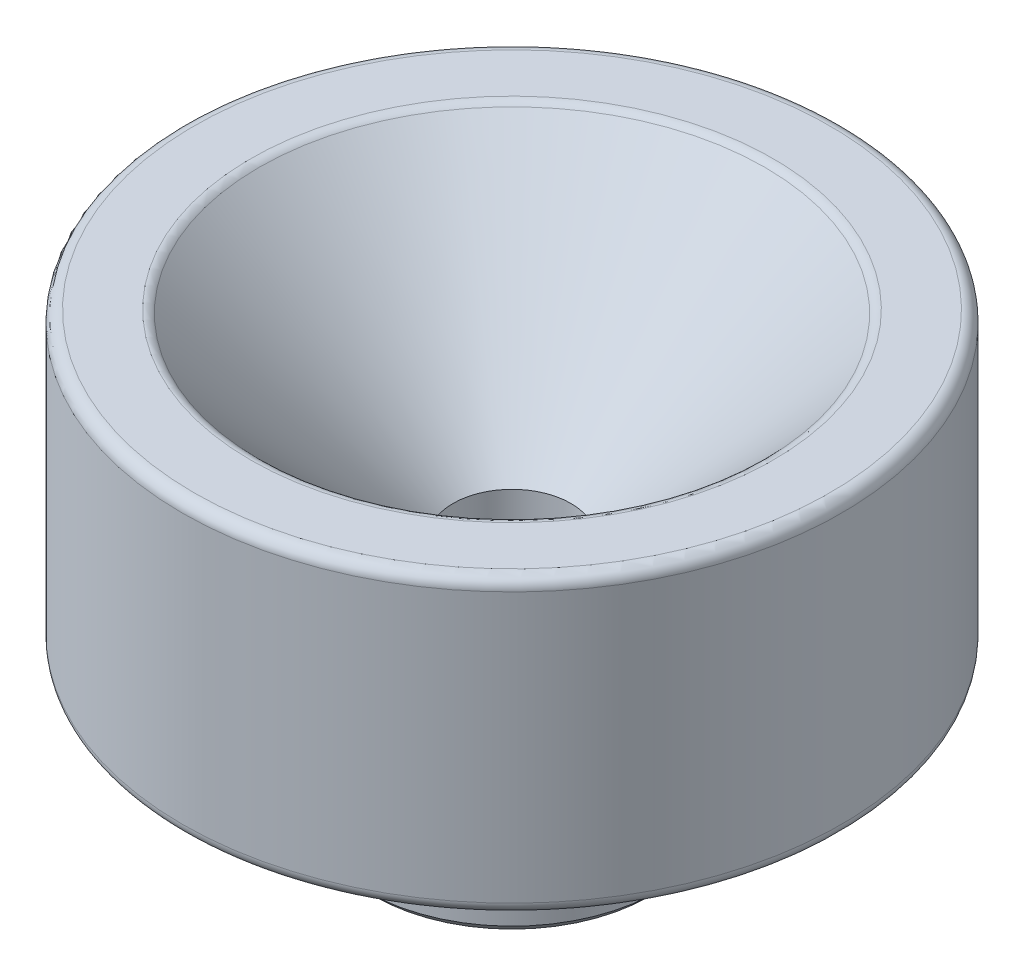
ISO-10303-21;
HEADER;
FILE_DESCRIPTION(('STEP AP214'),'2;1');
FILE_NAME('part.step','',(''),(''),'','','');
FILE_SCHEMA(('AUTOMOTIVE_DESIGN { 1 0 10303 214 1 1 1 1 }'));
ENDSEC;
DATA;
#1=APPLICATION_CONTEXT('core data for automotive mechanical design processes');
#2=APPLICATION_PROTOCOL_DEFINITION('international standard','automotive_design',2000,#1);
#3=PRODUCT_CONTEXT('',#1,'mechanical');
#4=PRODUCT('Part','Part','',(#3));
#5=PRODUCT_RELATED_PRODUCT_CATEGORY('part','',(#4));
#6=PRODUCT_DEFINITION_FORMATION('','',#4);
#7=PRODUCT_DEFINITION_CONTEXT('part definition',#1,'design');
#8=PRODUCT_DEFINITION('design','',#6,#7);
#9=PRODUCT_DEFINITION_SHAPE('','',#8);
#10=(LENGTH_UNIT() NAMED_UNIT(*) SI_UNIT(.MILLI.,.METRE.));
#11=(NAMED_UNIT(*) PLANE_ANGLE_UNIT() SI_UNIT($,.RADIAN.));
#12=(NAMED_UNIT(*) SI_UNIT($,.STERADIAN.) SOLID_ANGLE_UNIT());
#13=UNCERTAINTY_MEASURE_WITH_UNIT(LENGTH_MEASURE(1.E-05),#10,'distance_accuracy_value','');
#14=(GEOMETRIC_REPRESENTATION_CONTEXT(3) GLOBAL_UNCERTAINTY_ASSIGNED_CONTEXT((#13)) GLOBAL_UNIT_ASSIGNED_CONTEXT((#10,
#11,#12)) REPRESENTATION_CONTEXT('',''));
#15=CARTESIAN_POINT('',(0.,0.,0.));
#16=DIRECTION('',(0.,0.,1.));
#17=DIRECTION('',(1.,0.,0.));
#18=AXIS2_PLACEMENT_3D('',#15,#16,#17);
#19=CARTESIAN_POINT('',(6.35,0.,0.));
#20=DIRECTION('',(0.,-1.,0.));
#21=DIRECTION('',(0.,0.,-1.));
#22=AXIS2_PLACEMENT_3D('',#19,#20,#21);
#23=PLANE('',#22);
#24=CARTESIAN_POINT('',(0.,0.,0.));
#25=DIRECTION('',(0.,-1.,0.));
#26=DIRECTION('',(0.,0.,-1.));
#27=AXIS2_PLACEMENT_3D('',#24,#25,#26);
#28=CIRCLE('',#27,13.7795);
#29=CARTESIAN_POINT('',(0.,0.,-13.7795));
#30=VERTEX_POINT('',#29);
#31=EDGE_CURVE('E70',#30,#30,#28,.T.);
#32=ORIENTED_EDGE('',*,*,#31,.T.);
#33=EDGE_LOOP('',(#32));
#34=FACE_BOUND('',#33,.T.);
#35=CARTESIAN_POINT('',(0.,0.,0.));
#36=DIRECTION('',(0.,-1.,0.));
#37=DIRECTION('',(0.,0.,-1.));
#38=AXIS2_PLACEMENT_3D('',#35,#36,#37);
#39=CIRCLE('',#38,7.42596126628495);
#40=CARTESIAN_POINT('',(0.,0.,-7.42596126628495));
#41=VERTEX_POINT('',#40);
#42=EDGE_CURVE('E74',#41,#41,#39,.F.);
#43=ORIENTED_EDGE('',*,*,#42,.T.);
#44=EDGE_LOOP('',(#43));
#45=FACE_BOUND('',#44,.T.);
#46=ADVANCED_FACE('F35',(#34,#45),#23,.T.);
#47=CARTESIAN_POINT('',(0.,12.7,0.));
#48=DIRECTION('',(0.,1.,0.));
#49=DIRECTION('',(0.,0.,1.));
#50=AXIS2_PLACEMENT_3D('',#47,#48,#49);
#51=CONICAL_SURFACE('',#50,11.1125,0.785398163397443);
#52=CARTESIAN_POINT('',(0.,4.14019999999989,0.));
#53=DIRECTION('',(0.,1.,0.));
#54=DIRECTION('',(0.,0.,1.));
#55=AXIS2_PLACEMENT_3D('',#52,#53,#54);
#56=CIRCLE('',#55,2.55269999999999);
#57=CARTESIAN_POINT('',(0.,4.14019999999989,2.55269999999998));
#58=VERTEX_POINT('',#57);
#59=EDGE_CURVE('E77',#58,#58,#56,.T.);
#60=CARTESIAN_POINT('',(0.,12.5512102448428,0.));
#61=DIRECTION('',(0.,-1.,0.));
#62=DIRECTION('',(0.,0.,-1.));
#63=AXIS2_PLACEMENT_3D('',#60,#61,#62);
#64=CIRCLE('',#63,10.9637102448428);
#65=CARTESIAN_POINT('',(0.,12.5512102448428,10.9637102448428));
#66=VERTEX_POINT('',#65);
#67=EDGE_CURVE('E55',#66,#66,#64,.F.);
#68=CARTESIAN_POINT('',(0.,4.14019999999989,2.55269999999998));
#69=CARTESIAN_POINT('',(0.,4.22781469005034,2.64031469005043));
#70=CARTESIAN_POINT('',(0.,4.31542938010078,2.72792938010087));
#71=CARTESIAN_POINT('',(0.,4.49065876020168,2.90315876020177));
#72=CARTESIAN_POINT('',(0.,4.57827345025212,2.99077345025221));
#73=CARTESIAN_POINT('',(0.,4.75350283035302,3.1660028303531));
#74=CARTESIAN_POINT('',(0.,4.84111752040346,3.25361752040355));
#75=CARTESIAN_POINT('',(0.,5.01634690050436,3.42884690050444));
#76=CARTESIAN_POINT('',(0.,5.1039615905548,3.51646159055489));
#77=CARTESIAN_POINT('',(0.,5.2791909706557,3.69169097065578));
#78=CARTESIAN_POINT('',(0.,5.36680566070614,3.77930566070622));
#79=CARTESIAN_POINT('',(0.,5.54203504080704,3.95453504080711));
#80=CARTESIAN_POINT('',(0.,5.62964973085748,4.04214973085756));
#81=CARTESIAN_POINT('',(0.,5.80487911095838,4.21737911095845));
#82=CARTESIAN_POINT('',(0.,5.89249380100882,4.3049938010089));
#83=CARTESIAN_POINT('',(0.,6.06772318110972,4.48022318110979));
#84=CARTESIAN_POINT('',(0.,6.15533787116016,4.56783787116023));
#85=CARTESIAN_POINT('',(0.,6.33056725126106,4.74306725126112));
#86=CARTESIAN_POINT('',(0.,6.4181819413115,4.83068194131157));
#87=CARTESIAN_POINT('',(0.,6.5934113214124,5.00591132141246));
#88=CARTESIAN_POINT('',(0.,6.68102601146284,5.09352601146291));
#89=CARTESIAN_POINT('',(0.,6.85625539156374,5.2687553915638));
#90=CARTESIAN_POINT('',(0.,6.94387008161418,5.35637008161425));
#91=CARTESIAN_POINT('',(0.,7.11909946171508,5.53159946171514));
#92=CARTESIAN_POINT('',(0.,7.20671415176552,5.61921415176558));
#93=CARTESIAN_POINT('',(0.,7.38194353186642,5.79444353186647));
#94=CARTESIAN_POINT('',(0.,7.46955822191686,5.88205822191692));
#95=CARTESIAN_POINT('',(0.,7.64478760201776,6.05728760201781));
#96=CARTESIAN_POINT('',(0.,7.7324022920682,6.14490229206826));
#97=CARTESIAN_POINT('',(0.,7.9076316721691,6.32013167216915));
#98=CARTESIAN_POINT('',(0.,7.99524636221954,6.40774636221959));
#99=CARTESIAN_POINT('',(0.,8.17047574232044,6.58297574232048));
#100=CARTESIAN_POINT('',(0.,8.25809043237088,6.67059043237093));
#101=CARTESIAN_POINT('',(0.,8.43331981247178,6.84581981247182));
#102=CARTESIAN_POINT('',(0.,8.52093450252222,6.93343450252227));
#103=CARTESIAN_POINT('',(0.,8.69616388262311,7.10866388262316));
#104=CARTESIAN_POINT('',(0.,8.78377857267356,7.1962785726736));
#105=CARTESIAN_POINT('',(0.,8.95900795277445,7.37150795277449));
#106=CARTESIAN_POINT('',(0.,9.0466226428249,7.45912264282494));
#107=CARTESIAN_POINT('',(0.,9.2218520229258,7.63435202292583));
#108=CARTESIAN_POINT('',(0.,9.30946671297624,7.72196671297628));
#109=CARTESIAN_POINT('',(0.,9.48469609307713,7.89719609307717));
#110=CARTESIAN_POINT('',(0.,9.57231078312758,7.98481078312761));
#111=CARTESIAN_POINT('',(0.,9.74754016322848,8.1600401632285));
#112=CARTESIAN_POINT('',(0.,9.83515485327892,8.24765485327895));
#113=CARTESIAN_POINT('',(0.,10.0103842333798,8.42288423337984));
#114=CARTESIAN_POINT('',(0.,10.0979989234303,8.51049892343029));
#115=CARTESIAN_POINT('',(0.,10.2732283035312,8.68572830353118));
#116=CARTESIAN_POINT('',(0.,10.3608429935816,8.77334299358163));
#117=CARTESIAN_POINT('',(0.,10.5360723736825,8.94857237368252));
#118=CARTESIAN_POINT('',(0.,10.6236870637329,9.03618706373296));
#119=CARTESIAN_POINT('',(0.,10.7989164438338,9.21141644383385));
#120=CARTESIAN_POINT('',(0.,10.8865311338843,9.2990311338843));
#121=CARTESIAN_POINT('',(0.,11.0617605139852,9.47426051398519));
#122=CARTESIAN_POINT('',(0.,11.1493752040356,9.56187520403564));
#123=CARTESIAN_POINT('',(0.,11.3246045841365,9.73710458413653));
#124=CARTESIAN_POINT('',(0.,11.412219274187,9.82471927418697));
#125=CARTESIAN_POINT('',(0.,11.5874486542879,9.99994865428786));
#126=CARTESIAN_POINT('',(0.,11.6750633443383,10.0875633443383));
#127=CARTESIAN_POINT('',(0.,11.8502927244392,10.2627927244392));
#128=CARTESIAN_POINT('',(0.,11.9379074144896,10.3504074144896));
#129=CARTESIAN_POINT('',(0.,12.1131367945905,10.5256367945905));
#130=CARTESIAN_POINT('',(0.,12.200751484641,10.613251484641));
#131=CARTESIAN_POINT('',(0.,12.3759808647419,10.7884808647419));
#132=CARTESIAN_POINT('',(0.,12.4635955547923,10.8760955547923));
#133=CARTESIAN_POINT('',(0.,12.5512102448428,10.9637102448428));
#134=B_SPLINE_CURVE_WITH_KNOTS('',3,(#68,#69,#70,#71,#72,#73,#74,#75,#76,#77,#78,#79,#80,#81,
#82,#83,#84,#85,#86,#87,#88,#89,#90,#91,#92,#93,#94,#95,#96,#97,#98,#99,#100,#101,#102,#103,
#104,#105,#106,#107,#108,#109,#110,#111,#112,#113,#114,#115,#116,#117,#118,#119,#120,#121,#122,
#123,#124,#125,#126,#127,#128,#129,#130,#131,#132,#133),.UNSPECIFIED.,.F.,.F.,(4,2,2,2,2,2,2,2,
2,2,2,2,2,2,2,2,2,2,2,2,2,2,2,2,2,2,2,2,2,2,2,2,4),(0.,0.371717648797367,0.743435297594734,
1.1151529463921,1.48687059518947,1.85858824398684,2.23030589278421,2.60202354158158,
2.97374119037894,3.34545883917631,3.71717648797368,4.08889413677105,4.46061178556841,
4.83232943436578,5.20404708316315,5.57576473196052,5.94748238075789,6.31920002955525,
6.69091767835262,7.06263532714999,7.43435297594736,7.80607062474473,8.17778827354209,
8.54950592233946,8.92122357113683,9.29294121993419,9.66465886873156,10.0363765175289,
10.4080941663263,10.7798118151237,11.151529463921,11.5232471127184,11.8949647615158),.UNSPECIFIED.);
#135=EDGE_CURVE('BSEAM85',#58,#66,#134,.T.);
#136=ORIENTED_EDGE('',*,*,#59,.F.);
#137=ORIENTED_EDGE('',*,*,#67,.T.);
#138=ORIENTED_EDGE('',*,*,#135,.T.);
#139=ORIENTED_EDGE('',*,*,#135,.F.);
#140=EDGE_LOOP('',(#136,#138,#137,#139));
#141=FACE_BOUND('',#140,.T.);
#142=ADVANCED_FACE('F85',(#141),#51,.F.);
#143=CARTESIAN_POINT('',(14.2875,12.7,0.));
#144=DIRECTION('',(0.,1.,0.));
#145=DIRECTION('',(0.,0.,1.));
#146=AXIS2_PLACEMENT_3D('',#143,#144,#145);
#147=PLANE('',#146);
#148=CARTESIAN_POINT('',(0.,12.7,0.));
#149=DIRECTION('',(0.,1.,0.));
#150=DIRECTION('',(0.,0.,1.));
#151=AXIS2_PLACEMENT_3D('',#148,#149,#150);
#152=CIRCLE('',#151,13.7795);
#153=CARTESIAN_POINT('',(0.,12.7,13.7795));
#154=VERTEX_POINT('',#153);
#155=EDGE_CURVE('E58',#154,#154,#152,.T.);
#156=ORIENTED_EDGE('',*,*,#155,.T.);
#157=EDGE_LOOP('',(#156));
#158=FACE_BOUND('',#157,.T.);
#159=CARTESIAN_POINT('',(0.,12.7,0.));
#160=DIRECTION('',(0.,1.,0.));
#161=DIRECTION('',(0.,0.,1.));
#162=AXIS2_PLACEMENT_3D('',#159,#160,#161);
#163=CIRCLE('',#162,11.3229204896855);
#164=CARTESIAN_POINT('',(0.,12.7,11.3229204896855));
#165=VERTEX_POINT('',#164);
#166=EDGE_CURVE('E61',#165,#165,#163,.F.);
#167=ORIENTED_EDGE('',*,*,#166,.T.);
#168=EDGE_LOOP('',(#167));
#169=FACE_BOUND('',#168,.T.);
#170=ADVANCED_FACE('F88',(#158,#169),#147,.T.);
#171=CARTESIAN_POINT('',(0.,0.,0.));
#172=DIRECTION('',(0.,-1.,0.));
#173=DIRECTION('',(0.,0.,-1.));
#174=AXIS2_PLACEMENT_3D('',#171,#172,#173);
#175=CYLINDRICAL_SURFACE('',#174,14.2875);
#176=CARTESIAN_POINT('',(0.,0.508,0.));
#177=DIRECTION('',(0.,-1.,0.));
#178=DIRECTION('',(0.,0.,-1.));
#179=AXIS2_PLACEMENT_3D('',#176,#177,#178);
#180=CIRCLE('',#179,14.2875);
#181=CARTESIAN_POINT('',(0.,0.508,-14.2875));
#182=VERTEX_POINT('',#181);
#183=EDGE_CURVE('E64',#182,#182,#180,.F.);
#184=ORIENTED_EDGE('',*,*,#183,.T.);
#185=EDGE_LOOP('',(#184));
#186=FACE_BOUND('',#185,.T.);
#187=CARTESIAN_POINT('',(0.,12.192,0.));
#188=DIRECTION('',(0.,1.,0.));
#189=DIRECTION('',(0.,0.,1.));
#190=AXIS2_PLACEMENT_3D('',#187,#188,#189);
#191=CIRCLE('',#190,14.2875);
#192=CARTESIAN_POINT('',(0.,12.192,14.2875));
#193=VERTEX_POINT('',#192);
#194=EDGE_CURVE('E67',#193,#193,#191,.F.);
#195=ORIENTED_EDGE('',*,*,#194,.T.);
#196=EDGE_LOOP('',(#195));
#197=FACE_BOUND('',#196,.T.);
#198=ADVANCED_FACE('F101',(#186,#197),#175,.T.);
#199=CARTESIAN_POINT('',(0.,-0.508,0.));
#200=DIRECTION('',(0.,1.,0.));
#201=DIRECTION('',(0.,0.,1.));
#202=AXIS2_PLACEMENT_3D('',#199,#200,#201);
#203=TOROIDAL_SURFACE('',#202,6.858,0.762000000000001);
#204=CARTESIAN_POINT('',(0.,-1.07596126628495,0.));
#205=DIRECTION('',(0.,1.,0.));
#206=DIRECTION('',(0.,0.,1.));
#207=AXIS2_PLACEMENT_3D('',#204,#205,#206);
#208=CIRCLE('',#207,6.35);
#209=CARTESIAN_POINT('',(0.,-1.07596126628495,6.35));
#210=VERTEX_POINT('',#209);
#211=EDGE_CURVE('E73',#210,#210,#208,.F.);
#212=ORIENTED_EDGE('',*,*,#211,.F.);
#213=EDGE_LOOP('',(#212));
#214=FACE_BOUND('',#213,.T.);
#215=ORIENTED_EDGE('',*,*,#42,.F.);
#216=EDGE_LOOP('',(#215));
#217=FACE_BOUND('',#216,.T.);
#218=ADVANCED_FACE('F107',(#214,#217),#203,.F.);
#219=CARTESIAN_POINT('',(0.,-6.35,0.));
#220=DIRECTION('',(0.,-1.,0.));
#221=DIRECTION('',(0.,0.,-1.));
#222=AXIS2_PLACEMENT_3D('',#219,#220,#221);
#223=PLANE('',#222);
#224=CARTESIAN_POINT('',(0.,-6.35,0.));
#225=DIRECTION('',(0.,-1.,0.));
#226=DIRECTION('',(0.,0.,-1.));
#227=AXIS2_PLACEMENT_3D('',#224,#225,#226);
#228=CIRCLE('',#227,2.9337);
#229=CARTESIAN_POINT('',(0.,-6.35,-2.9337));
#230=VERTEX_POINT('',#229);
#231=EDGE_CURVE('E10',#230,#230,#228,.F.);
#232=ORIENTED_EDGE('',*,*,#231,.T.);
#233=EDGE_LOOP('',(#232));
#234=FACE_BOUND('',#233,.T.);
#235=CARTESIAN_POINT('',(0.,-6.35,0.));
#236=DIRECTION('',(0.,-1.,0.));
#237=DIRECTION('',(0.,0.,-1.));
#238=AXIS2_PLACEMENT_3D('',#235,#236,#237);
#239=CIRCLE('',#238,5.96900000000001);
#240=CARTESIAN_POINT('',(0.,-6.35,-5.96900000000001));
#241=VERTEX_POINT('',#240);
#242=EDGE_CURVE('E50',#241,#241,#239,.T.);
#243=ORIENTED_EDGE('',*,*,#242,.T.);
#244=EDGE_LOOP('',(#243));
#245=FACE_BOUND('',#244,.T.);
#246=ADVANCED_FACE('F119',(#234,#245),#223,.T.);
#247=CARTESIAN_POINT('',(0.,0.,0.));
#248=DIRECTION('',(0.,-1.,0.));
#249=DIRECTION('',(0.,0.,-1.));
#250=AXIS2_PLACEMENT_3D('',#247,#248,#249);
#251=CYLINDRICAL_SURFACE('',#250,6.35);
#252=CARTESIAN_POINT('',(0.,-5.96900000000001,0.));
#253=DIRECTION('',(0.,-1.,0.));
#254=DIRECTION('',(0.,0.,-1.));
#255=AXIS2_PLACEMENT_3D('',#252,#253,#254);
#256=CIRCLE('',#255,6.35);
#257=CARTESIAN_POINT('',(0.,-5.96900000000001,-6.35));
#258=VERTEX_POINT('',#257);
#259=EDGE_CURVE('E46',#258,#258,#256,.F.);
#260=ORIENTED_EDGE('',*,*,#259,.T.);
#261=EDGE_LOOP('',(#260));
#262=FACE_BOUND('',#261,.T.);
#263=ORIENTED_EDGE('',*,*,#211,.T.);
#264=EDGE_LOOP('',(#263));
#265=FACE_BOUND('',#264,.T.);
#266=ADVANCED_FACE('F139',(#262,#265),#251,.T.);
#267=CARTESIAN_POINT('',(0.,0.508,0.));
#268=DIRECTION('',(0.,-1.,0.));
#269=DIRECTION('',(0.,0.,-1.));
#270=AXIS2_PLACEMENT_3D('',#267,#268,#269);
#271=TOROIDAL_SURFACE('',#270,13.7795,0.508);
#272=ORIENTED_EDGE('',*,*,#183,.F.);
#273=EDGE_LOOP('',(#272));
#274=FACE_BOUND('',#273,.T.);
#275=ORIENTED_EDGE('',*,*,#31,.F.);
#276=EDGE_LOOP('',(#275));
#277=FACE_BOUND('',#276,.T.);
#278=ADVANCED_FACE('F135',(#274,#277),#271,.T.);
#279=CARTESIAN_POINT('',(0.,12.192,0.));
#280=DIRECTION('',(0.,1.,0.));
#281=DIRECTION('',(0.,0.,1.));
#282=AXIS2_PLACEMENT_3D('',#279,#280,#281);
#283=TOROIDAL_SURFACE('',#282,13.7795,0.508);
#284=ORIENTED_EDGE('',*,*,#155,.F.);
#285=EDGE_LOOP('',(#284));
#286=FACE_BOUND('',#285,.T.);
#287=ORIENTED_EDGE('',*,*,#194,.F.);
#288=EDGE_LOOP('',(#287));
#289=FACE_BOUND('',#288,.T.);
#290=ADVANCED_FACE('F96',(#286,#289),#283,.T.);
#291=CARTESIAN_POINT('',(0.,12.192,0.));
#292=DIRECTION('',(0.,1.,0.));
#293=DIRECTION('',(0.,0.,1.));
#294=AXIS2_PLACEMENT_3D('',#291,#292,#293);
#295=TOROIDAL_SURFACE('',#294,11.3229204896855,0.508);
#296=ORIENTED_EDGE('',*,*,#67,.F.);
#297=EDGE_LOOP('',(#296));
#298=FACE_BOUND('',#297,.T.);
#299=ORIENTED_EDGE('',*,*,#166,.F.);
#300=EDGE_LOOP('',(#299));
#301=FACE_BOUND('',#300,.T.);
#302=ADVANCED_FACE('F92',(#298,#301),#295,.T.);
#303=CARTESIAN_POINT('',(0.,-6.35,0.));
#304=DIRECTION('',(0.,1.,0.));
#305=DIRECTION('',(0.,0.,1.));
#306=AXIS2_PLACEMENT_3D('',#303,#304,#305);
#307=CONICAL_SURFACE('',#306,5.96900000000001,0.785398163397447);
#308=ORIENTED_EDGE('',*,*,#259,.F.);
#309=EDGE_LOOP('',(#308));
#310=FACE_BOUND('',#309,.T.);
#311=ORIENTED_EDGE('',*,*,#242,.F.);
#312=EDGE_LOOP('',(#311));
#313=FACE_BOUND('',#312,.T.);
#314=ADVANCED_FACE('F95',(#310,#313),#307,.T.);
#315=CARTESIAN_POINT('',(0.,-6.35,0.));
#316=DIRECTION('',(0.,-1.,0.));
#317=DIRECTION('',(0.,0.,-1.));
#318=AXIS2_PLACEMENT_3D('',#315,#316,#317);
#319=CYLINDRICAL_SURFACE('',#318,2.55269999999999);
#320=CARTESIAN_POINT('',(0.,-5.969,0.));
#321=DIRECTION('',(0.,-1.,0.));
#322=DIRECTION('',(0.,0.,-1.));
#323=AXIS2_PLACEMENT_3D('',#320,#321,#322);
#324=CIRCLE('',#323,2.55269999999999);
#325=CARTESIAN_POINT('',(0.,-5.969,-2.55269999999999));
#326=VERTEX_POINT('',#325);
#327=EDGE_CURVE('E42',#326,#326,#324,.T.);
#328=ORIENTED_EDGE('',*,*,#327,.T.);
#329=EDGE_LOOP('',(#328));
#330=FACE_BOUND('',#329,.T.);
#331=ORIENTED_EDGE('',*,*,#59,.T.);
#332=EDGE_LOOP('',(#331));
#333=FACE_BOUND('',#332,.T.);
#334=ADVANCED_FACE('F83',(#330,#333),#319,.F.);
#335=CARTESIAN_POINT('',(0.,-5.969,0.));
#336=DIRECTION('',(0.,-1.,0.));
#337=DIRECTION('',(0.,0.,-1.));
#338=AXIS2_PLACEMENT_3D('',#335,#336,#337);
#339=CONICAL_SURFACE('',#338,2.55269999999999,0.785398163397465);
#340=ORIENTED_EDGE('',*,*,#231,.F.);
#341=EDGE_LOOP('',(#340));
#342=FACE_BOUND('',#341,.T.);
#343=ORIENTED_EDGE('',*,*,#327,.F.);
#344=EDGE_LOOP('',(#343));
#345=FACE_BOUND('',#344,.T.);
#346=ADVANCED_FACE('F37',(#342,#345),#339,.F.);
#347=CLOSED_SHELL('',(#46,#142,#170,#198,#218,#246,#266,#278,#290,#302,#314,#334,#346));
#348=MANIFOLD_SOLID_BREP('B2',#347);
#349=ADVANCED_BREP_SHAPE_REPRESENTATION('',(#18,#348),#14);
#350=SHAPE_DEFINITION_REPRESENTATION(#9,#349);
ENDSEC;
END-ISO-10303-21;
